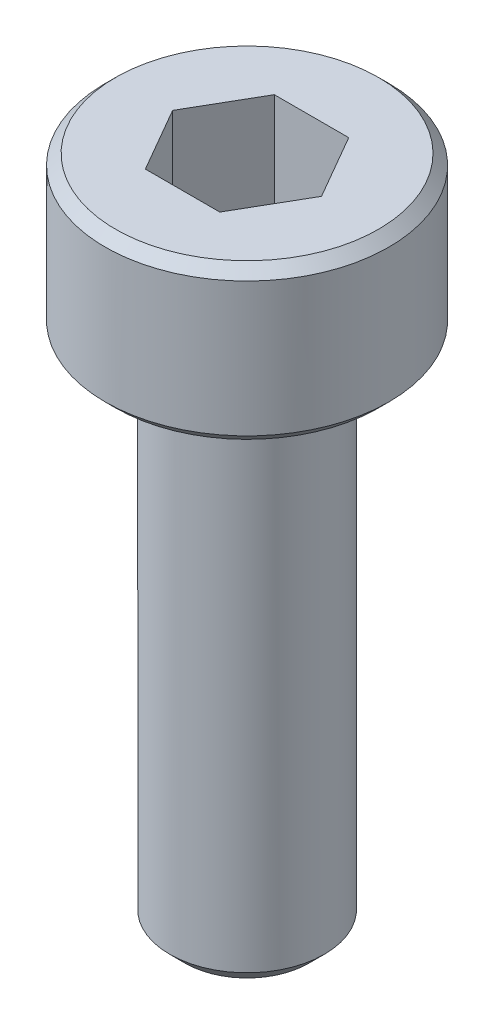
ISO-10303-21;
HEADER;
FILE_DESCRIPTION(('STEP AP214'),'2;1');
FILE_NAME('part.step','',(''),(''),'','','');
FILE_SCHEMA(('AUTOMOTIVE_DESIGN { 1 0 10303 214 1 1 1 1 }'));
ENDSEC;
DATA;
#1=APPLICATION_CONTEXT('core data for automotive mechanical design processes');
#2=APPLICATION_PROTOCOL_DEFINITION('international standard','automotive_design',2000,#1);
#3=PRODUCT_CONTEXT('',#1,'mechanical');
#4=PRODUCT('Part','Part','',(#3));
#5=PRODUCT_RELATED_PRODUCT_CATEGORY('part','',(#4));
#6=PRODUCT_DEFINITION_FORMATION('','',#4);
#7=PRODUCT_DEFINITION_CONTEXT('part definition',#1,'design');
#8=PRODUCT_DEFINITION('design','',#6,#7);
#9=PRODUCT_DEFINITION_SHAPE('','',#8);
#10=(LENGTH_UNIT() NAMED_UNIT(*) SI_UNIT(.MILLI.,.METRE.));
#11=(NAMED_UNIT(*) PLANE_ANGLE_UNIT() SI_UNIT($,.RADIAN.));
#12=(NAMED_UNIT(*) SI_UNIT($,.STERADIAN.) SOLID_ANGLE_UNIT());
#13=UNCERTAINTY_MEASURE_WITH_UNIT(LENGTH_MEASURE(1.E-05),#10,'distance_accuracy_value','');
#14=(GEOMETRIC_REPRESENTATION_CONTEXT(3) GLOBAL_UNCERTAINTY_ASSIGNED_CONTEXT((#13)) GLOBAL_UNIT_ASSIGNED_CONTEXT((#10,
#11,#12)) REPRESENTATION_CONTEXT('',''));
#15=CARTESIAN_POINT('',(0.,0.,0.));
#16=DIRECTION('',(0.,0.,1.));
#17=DIRECTION('',(1.,0.,0.));
#18=AXIS2_PLACEMENT_3D('',#15,#16,#17);
#19=CARTESIAN_POINT('',(0.721687836487033,11.,1.25));
#20=DIRECTION('',(0.866025403784439,0.,0.5));
#21=DIRECTION('',(0.5,0.,-0.866025403784439));
#22=AXIS2_PLACEMENT_3D('',#19,#20,#21);
#23=PLANE('',#22);
#24=DIRECTION('',(0.5,0.,-0.866025403784439));
#25=VECTOR('',#24,1.);
#26=CARTESIAN_POINT('',(0.721687836487033,11.,1.25));
#27=LINE('',#26,#25);
#28=CARTESIAN_POINT('',(0.721687836487033,11.,1.25));
#29=VERTEX_POINT('',#28);
#30=CARTESIAN_POINT('',(1.44337567297406,11.,0.));
#31=VERTEX_POINT('',#30);
#32=EDGE_CURVE('E66',#29,#31,#27,.T.);
#33=ORIENTED_EDGE('',*,*,#32,.F.);
#34=DIRECTION('',(0.,1.,0.));
#35=VECTOR('',#34,1.);
#36=CARTESIAN_POINT('',(0.721687836487033,11.,1.25));
#37=LINE('',#36,#35);
#38=CARTESIAN_POINT('',(0.721687836487033,13.,1.25));
#39=VERTEX_POINT('',#38);
#40=EDGE_CURVE('E85',#29,#39,#37,.T.);
#41=ORIENTED_EDGE('',*,*,#40,.T.);
#42=DIRECTION('',(0.5,0.,-0.866025403784439));
#43=VECTOR('',#42,1.);
#44=CARTESIAN_POINT('',(0.721687836487033,13.,1.25));
#45=LINE('',#44,#43);
#46=CARTESIAN_POINT('',(1.44337567297406,13.,0.));
#47=VERTEX_POINT('',#46);
#48=EDGE_CURVE('E73',#47,#39,#45,.F.);
#49=ORIENTED_EDGE('',*,*,#48,.F.);
#50=DIRECTION('',(0.,1.,0.));
#51=VECTOR('',#50,1.);
#52=CARTESIAN_POINT('',(1.44337567297406,11.,0.));
#53=LINE('',#52,#51);
#54=EDGE_CURVE('E80',#47,#31,#53,.F.);
#55=ORIENTED_EDGE('',*,*,#54,.T.);
#56=EDGE_LOOP('',(#33,#41,#49,#55));
#57=FACE_BOUND('',#56,.T.);
#58=ADVANCED_FACE('F17',(#57),#23,.F.);
#59=CARTESIAN_POINT('',(1.44337567297406,11.,0.));
#60=DIRECTION('',(0.866025403784438,0.,-0.5));
#61=DIRECTION('',(-0.5,0.,-0.866025403784438));
#62=AXIS2_PLACEMENT_3D('',#59,#60,#61);
#63=PLANE('',#62);
#64=DIRECTION('',(-0.5,0.,-0.866025403784438));
#65=VECTOR('',#64,1.);
#66=CARTESIAN_POINT('',(1.44337567297406,11.,0.));
#67=LINE('',#66,#65);
#68=CARTESIAN_POINT('',(0.721687836487031,11.,-1.25));
#69=VERTEX_POINT('',#68);
#70=EDGE_CURVE('E89',#31,#69,#67,.T.);
#71=ORIENTED_EDGE('',*,*,#70,.F.);
#72=ORIENTED_EDGE('',*,*,#54,.F.);
#73=DIRECTION('',(-0.5,0.,-0.866025403784438));
#74=VECTOR('',#73,1.);
#75=CARTESIAN_POINT('',(1.44337567297406,13.,0.));
#76=LINE('',#75,#74);
#77=CARTESIAN_POINT('',(0.721687836487032,13.,-1.25));
#78=VERTEX_POINT('',#77);
#79=EDGE_CURVE('E70',#78,#47,#76,.F.);
#80=ORIENTED_EDGE('',*,*,#79,.F.);
#81=DIRECTION('',(0.,1.,0.));
#82=VECTOR('',#81,1.);
#83=CARTESIAN_POINT('',(0.721687836487031,11.,-1.25));
#84=LINE('',#83,#82);
#85=EDGE_CURVE('E133',#78,#69,#84,.F.);
#86=ORIENTED_EDGE('',*,*,#85,.T.);
#87=EDGE_LOOP('',(#71,#72,#80,#86));
#88=FACE_BOUND('',#87,.T.);
#89=ADVANCED_FACE('F88',(#88),#63,.F.);
#90=CARTESIAN_POINT('',(-0.721687836487032,11.,1.25));
#91=DIRECTION('',(0.,0.,1.));
#92=DIRECTION('',(1.,0.,0.));
#93=AXIS2_PLACEMENT_3D('',#90,#91,#92);
#94=PLANE('',#93);
#95=DIRECTION('',(1.,0.,0.));
#96=VECTOR('',#95,1.);
#97=CARTESIAN_POINT('',(1.44337567297406,11.,1.25));
#98=LINE('',#97,#96);
#99=CARTESIAN_POINT('',(-0.721687836487032,11.,1.25));
#100=VERTEX_POINT('',#99);
#101=EDGE_CURVE('E131',#100,#29,#98,.T.);
#102=ORIENTED_EDGE('',*,*,#101,.F.);
#103=DIRECTION('',(0.,1.,0.));
#104=VECTOR('',#103,1.);
#105=CARTESIAN_POINT('',(-0.721687836487032,11.,1.25));
#106=LINE('',#105,#104);
#107=CARTESIAN_POINT('',(-0.721687836487032,13.,1.25));
#108=VERTEX_POINT('',#107);
#109=EDGE_CURVE('E121',#100,#108,#106,.T.);
#110=ORIENTED_EDGE('',*,*,#109,.T.);
#111=DIRECTION('',(1.,0.,0.));
#112=VECTOR('',#111,1.);
#113=CARTESIAN_POINT('',(-0.721687836487032,13.,1.25));
#114=LINE('',#113,#112);
#115=EDGE_CURVE('E91',#39,#108,#114,.F.);
#116=ORIENTED_EDGE('',*,*,#115,.F.);
#117=ORIENTED_EDGE('',*,*,#40,.F.);
#118=EDGE_LOOP('',(#102,#110,#116,#117));
#119=FACE_BOUND('',#118,.T.);
#120=ADVANCED_FACE('F138',(#119),#94,.F.);
#121=CARTESIAN_POINT('',(0.721687836487031,11.,-1.25));
#122=DIRECTION('',(0.,0.,-1.));
#123=DIRECTION('',(-1.,0.,0.));
#124=AXIS2_PLACEMENT_3D('',#121,#122,#123);
#125=PLANE('',#124);
#126=DIRECTION('',(1.,0.,0.));
#127=VECTOR('',#126,1.);
#128=CARTESIAN_POINT('',(1.44337567297406,11.,-1.25));
#129=LINE('',#128,#127);
#130=CARTESIAN_POINT('',(-0.721687836487032,11.,-1.25));
#131=VERTEX_POINT('',#130);
#132=EDGE_CURVE('E128',#69,#131,#129,.F.);
#133=ORIENTED_EDGE('',*,*,#132,.F.);
#134=ORIENTED_EDGE('',*,*,#85,.F.);
#135=DIRECTION('',(-1.,0.,0.));
#136=VECTOR('',#135,1.);
#137=CARTESIAN_POINT('',(0.721687836487031,13.,-1.25));
#138=LINE('',#137,#136);
#139=CARTESIAN_POINT('',(-0.721687836487032,13.,-1.25));
#140=VERTEX_POINT('',#139);
#141=EDGE_CURVE('E75',#140,#78,#138,.F.);
#142=ORIENTED_EDGE('',*,*,#141,.F.);
#143=DIRECTION('',(0.,1.,0.));
#144=VECTOR('',#143,1.);
#145=CARTESIAN_POINT('',(-0.721687836487032,11.,-1.25));
#146=LINE('',#145,#144);
#147=EDGE_CURVE('E119',#140,#131,#146,.F.);
#148=ORIENTED_EDGE('',*,*,#147,.T.);
#149=EDGE_LOOP('',(#133,#134,#142,#148));
#150=FACE_BOUND('',#149,.T.);
#151=ADVANCED_FACE('F150',(#150),#125,.F.);
#152=CARTESIAN_POINT('',(1.44337567297406,11.,0.));
#153=DIRECTION('',(0.,1.,0.));
#154=DIRECTION('',(0.,0.,1.));
#155=AXIS2_PLACEMENT_3D('',#152,#153,#154);
#156=PLANE('',#155);
#157=ORIENTED_EDGE('',*,*,#132,.T.);
#158=DIRECTION('',(-0.5,0.,0.866025403784439));
#159=VECTOR('',#158,1.);
#160=CARTESIAN_POINT('',(-0.721687836487032,11.,-1.25));
#161=LINE('',#160,#159);
#162=CARTESIAN_POINT('',(-1.44337567297406,11.,0.));
#163=VERTEX_POINT('',#162);
#164=EDGE_CURVE('E117',#131,#163,#161,.T.);
#165=ORIENTED_EDGE('',*,*,#164,.T.);
#166=DIRECTION('',(0.5,0.,0.866025403784438));
#167=VECTOR('',#166,1.);
#168=CARTESIAN_POINT('',(-1.44337567297406,11.,0.));
#169=LINE('',#168,#167);
#170=EDGE_CURVE('E124',#163,#100,#169,.T.);
#171=ORIENTED_EDGE('',*,*,#170,.T.);
#172=ORIENTED_EDGE('',*,*,#101,.T.);
#173=ORIENTED_EDGE('',*,*,#32,.T.);
#174=ORIENTED_EDGE('',*,*,#70,.T.);
#175=EDGE_LOOP('',(#157,#165,#171,#172,#173,#174));
#176=FACE_BOUND('',#175,.T.);
#177=ADVANCED_FACE('F151',(#176),#156,.T.);
#178=CARTESIAN_POINT('',(-1.44337567297406,11.,0.));
#179=DIRECTION('',(-0.866025403784438,0.,0.5));
#180=DIRECTION('',(0.5,0.,0.866025403784438));
#181=AXIS2_PLACEMENT_3D('',#178,#179,#180);
#182=PLANE('',#181);
#183=ORIENTED_EDGE('',*,*,#170,.F.);
#184=DIRECTION('',(0.,1.,0.));
#185=VECTOR('',#184,1.);
#186=CARTESIAN_POINT('',(-1.44337567297407,11.,0.));
#187=LINE('',#186,#185);
#188=CARTESIAN_POINT('',(-1.44337567297406,13.,0.));
#189=VERTEX_POINT('',#188);
#190=EDGE_CURVE('E115',#163,#189,#187,.T.);
#191=ORIENTED_EDGE('',*,*,#190,.T.);
#192=DIRECTION('',(0.5,0.,0.866025403784438));
#193=VECTOR('',#192,1.);
#194=CARTESIAN_POINT('',(-1.44337567297406,13.,0.));
#195=LINE('',#194,#193);
#196=EDGE_CURVE('E35',#108,#189,#195,.F.);
#197=ORIENTED_EDGE('',*,*,#196,.F.);
#198=ORIENTED_EDGE('',*,*,#109,.F.);
#199=EDGE_LOOP('',(#183,#191,#197,#198));
#200=FACE_BOUND('',#199,.T.);
#201=ADVANCED_FACE('F141',(#200),#182,.F.);
#202=CARTESIAN_POINT('',(-0.721687836487032,11.,-1.25));
#203=DIRECTION('',(-0.866025403784439,0.,-0.5));
#204=DIRECTION('',(-0.5,0.,0.866025403784439));
#205=AXIS2_PLACEMENT_3D('',#202,#203,#204);
#206=PLANE('',#205);
#207=ORIENTED_EDGE('',*,*,#164,.F.);
#208=ORIENTED_EDGE('',*,*,#147,.F.);
#209=DIRECTION('',(0.5,0.,-0.866025403784438));
#210=VECTOR('',#209,1.);
#211=CARTESIAN_POINT('',(-1.44337567297406,13.,0.));
#212=LINE('',#211,#210);
#213=EDGE_CURVE('E113',#189,#140,#212,.T.);
#214=ORIENTED_EDGE('',*,*,#213,.F.);
#215=ORIENTED_EDGE('',*,*,#190,.F.);
#216=EDGE_LOOP('',(#207,#208,#214,#215));
#217=FACE_BOUND('',#216,.T.);
#218=ADVANCED_FACE('F147',(#217),#206,.F.);
#219=CARTESIAN_POINT('',(0.,13.,-2.75));
#220=DIRECTION('',(0.,1.,0.));
#221=DIRECTION('',(0.,0.,1.));
#222=AXIS2_PLACEMENT_3D('',#219,#220,#221);
#223=PLANE('',#222);
#224=CARTESIAN_POINT('',(0.,13.0000000000337,0.));
#225=DIRECTION('',(0.,-1.,0.));
#226=DIRECTION('',(0.,0.,-1.));
#227=AXIS2_PLACEMENT_3D('',#224,#225,#226);
#228=CIRCLE('',#227,2.54999999992833);
#229=CARTESIAN_POINT('',(0.,13.0000000000337,-2.54999999992833));
#230=VERTEX_POINT('',#229);
#231=EDGE_CURVE('E20',#230,#230,#228,.T.);
#232=ORIENTED_EDGE('',*,*,#231,.F.);
#233=EDGE_LOOP('',(#232));
#234=FACE_BOUND('',#233,.T.);
#235=ORIENTED_EDGE('',*,*,#196,.T.);
#236=ORIENTED_EDGE('',*,*,#213,.T.);
#237=ORIENTED_EDGE('',*,*,#141,.T.);
#238=ORIENTED_EDGE('',*,*,#79,.T.);
#239=ORIENTED_EDGE('',*,*,#48,.T.);
#240=ORIENTED_EDGE('',*,*,#115,.T.);
#241=EDGE_LOOP('',(#235,#236,#237,#238,#239,#240));
#242=FACE_BOUND('',#241,.T.);
#243=ADVANCED_FACE('F72',(#234,#242),#223,.T.);
#244=CARTESIAN_POINT('',(0.,12.8000000000839,0.));
#245=DIRECTION('',(0.,-1.,0.));
#246=DIRECTION('',(0.,0.,-1.));
#247=AXIS2_PLACEMENT_3D('',#244,#245,#246);
#248=CONICAL_SURFACE('',#247,2.74999999987813,0.785398163397448);
#249=CARTESIAN_POINT('',(0.,12.8,0.));
#250=DIRECTION('',(0.,-1.,0.));
#251=DIRECTION('',(0.,0.,-1.));
#252=AXIS2_PLACEMENT_3D('',#249,#250,#251);
#253=CIRCLE('',#252,2.75);
#254=CARTESIAN_POINT('',(0.,12.8,-2.75));
#255=VERTEX_POINT('',#254);
#256=EDGE_CURVE('E106',#255,#255,#253,.T.);
#257=ORIENTED_EDGE('',*,*,#256,.F.);
#258=EDGE_LOOP('',(#257));
#259=FACE_BOUND('',#258,.T.);
#260=ORIENTED_EDGE('',*,*,#231,.T.);
#261=EDGE_LOOP('',(#260));
#262=FACE_BOUND('',#261,.T.);
#263=ADVANCED_FACE('F186',(#259,#262),#248,.T.);
#264=CARTESIAN_POINT('',(0.,0.,0.));
#265=DIRECTION('',(0.,-1.,0.));
#266=DIRECTION('',(0.,0.,-1.));
#267=AXIS2_PLACEMENT_3D('',#264,#265,#266);
#268=CYLINDRICAL_SURFACE('',#267,2.75);
#269=CARTESIAN_POINT('',(0.,10.1999999999407,0.));
#270=DIRECTION('',(0.,1.,0.));
#271=DIRECTION('',(0.,0.,1.));
#272=AXIS2_PLACEMENT_3D('',#269,#270,#271);
#273=CIRCLE('',#272,2.74999999993497);
#274=CARTESIAN_POINT('',(0.,10.1999999999407,2.74999999993497));
#275=VERTEX_POINT('',#274);
#276=EDGE_CURVE('E102',#275,#275,#273,.F.);
#277=ORIENTED_EDGE('',*,*,#276,.F.);
#278=EDGE_LOOP('',(#277));
#279=FACE_BOUND('',#278,.T.);
#280=ORIENTED_EDGE('',*,*,#256,.T.);
#281=EDGE_LOOP('',(#280));
#282=FACE_BOUND('',#281,.T.);
#283=ADVANCED_FACE('F183',(#279,#282),#268,.T.);
#284=CARTESIAN_POINT('',(0.,10.199999999827,0.));
#285=DIRECTION('',(0.,1.,0.));
#286=DIRECTION('',(0.,0.,1.));
#287=AXIS2_PLACEMENT_3D('',#284,#285,#286);
#288=CONICAL_SURFACE('',#287,2.74999999982128,0.785398163397448);
#289=ORIENTED_EDGE('',*,*,#276,.T.);
#290=EDGE_LOOP('',(#289));
#291=FACE_BOUND('',#290,.T.);
#292=CARTESIAN_POINT('',(0.,9.99999999993406,0.));
#293=DIRECTION('',(0.,1.,0.));
#294=DIRECTION('',(0.,0.,1.));
#295=AXIS2_PLACEMENT_3D('',#292,#293,#294);
#296=CIRCLE('',#295,2.54999999992833);
#297=CARTESIAN_POINT('',(0.,9.99999999993406,2.54999999992833));
#298=VERTEX_POINT('',#297);
#299=EDGE_CURVE('E100',#298,#298,#296,.F.);
#300=ORIENTED_EDGE('',*,*,#299,.F.);
#301=EDGE_LOOP('',(#300));
#302=FACE_BOUND('',#301,.T.);
#303=ADVANCED_FACE('F179',(#291,#302),#288,.T.);
#304=CARTESIAN_POINT('',(0.,0.,0.));
#305=DIRECTION('',(0.,-1.,0.));
#306=DIRECTION('',(0.,0.,-1.));
#307=AXIS2_PLACEMENT_3D('',#304,#305,#306);
#308=PLANE('',#307);
#309=CARTESIAN_POINT('',(0.,5.6843418860808E-11,0.));
#310=DIRECTION('',(0.,1.,0.));
#311=DIRECTION('',(0.,0.,1.));
#312=AXIS2_PLACEMENT_3D('',#309,#310,#311);
#313=CIRCLE('',#312,1.20000000003984);
#314=CARTESIAN_POINT('',(0.,5.6843418860808E-11,1.20000000003984));
#315=VERTEX_POINT('',#314);
#316=EDGE_CURVE('E98',#315,#315,#313,.T.);
#317=ORIENTED_EDGE('',*,*,#316,.F.);
#318=EDGE_LOOP('',(#317));
#319=FACE_BOUND('',#318,.T.);
#320=ADVANCED_FACE('F176',(#319),#308,.T.);
#321=CARTESIAN_POINT('',(0.,10.,-1.5));
#322=DIRECTION('',(0.,-1.,0.));
#323=DIRECTION('',(0.,0.,-1.));
#324=AXIS2_PLACEMENT_3D('',#321,#322,#323);
#325=PLANE('',#324);
#326=ORIENTED_EDGE('',*,*,#299,.T.);
#327=EDGE_LOOP('',(#326));
#328=FACE_BOUND('',#327,.T.);
#329=CARTESIAN_POINT('',(0.,10.,0.));
#330=DIRECTION('',(0.,-1.,0.));
#331=DIRECTION('',(0.,0.,-1.));
#332=AXIS2_PLACEMENT_3D('',#329,#330,#331);
#333=CIRCLE('',#332,1.5);
#334=CARTESIAN_POINT('',(0.,10.,-1.5));
#335=VERTEX_POINT('',#334);
#336=EDGE_CURVE('E26',#335,#335,#333,.T.);
#337=ORIENTED_EDGE('',*,*,#336,.F.);
#338=EDGE_LOOP('',(#337));
#339=FACE_BOUND('',#338,.T.);
#340=ADVANCED_FACE('F169',(#328,#339),#325,.T.);
#341=CARTESIAN_POINT('',(0.,0.300000000038381,0.));
#342=DIRECTION('',(0.,1.,0.));
#343=DIRECTION('',(0.,0.,1.));
#344=AXIS2_PLACEMENT_3D('',#341,#342,#343);
#345=CONICAL_SURFACE('',#344,1.50000000002137,0.785398163397448);
#346=CARTESIAN_POINT('',(0.,0.300000000000003,0.));
#347=DIRECTION('',(0.,-1.,0.));
#348=DIRECTION('',(0.,0.,-1.));
#349=AXIS2_PLACEMENT_3D('',#346,#347,#348);
#350=CIRCLE('',#349,1.5);
#351=CARTESIAN_POINT('',(0.,0.300000000000003,-1.5));
#352=VERTEX_POINT('',#351);
#353=EDGE_CURVE('E11',#352,#352,#350,.F.);
#354=ORIENTED_EDGE('',*,*,#353,.F.);
#355=EDGE_LOOP('',(#354));
#356=FACE_BOUND('',#355,.T.);
#357=ORIENTED_EDGE('',*,*,#316,.T.);
#358=EDGE_LOOP('',(#357));
#359=FACE_BOUND('',#358,.T.);
#360=ADVANCED_FACE('F163',(#356,#359),#345,.T.);
#361=CARTESIAN_POINT('',(0.,0.,0.));
#362=DIRECTION('',(0.,-1.,0.));
#363=DIRECTION('',(0.,0.,-1.));
#364=AXIS2_PLACEMENT_3D('',#361,#362,#363);
#365=CYLINDRICAL_SURFACE('',#364,1.5);
#366=ORIENTED_EDGE('',*,*,#353,.T.);
#367=EDGE_LOOP('',(#366));
#368=FACE_BOUND('',#367,.T.);
#369=ORIENTED_EDGE('',*,*,#336,.T.);
#370=EDGE_LOOP('',(#369));
#371=FACE_BOUND('',#370,.T.);
#372=ADVANCED_FACE('F161',(#368,#371),#365,.T.);
#373=CLOSED_SHELL('',(#58,#89,#120,#151,#177,#201,#218,#243,#263,#283,#303,#320,#340,#360,#372));
#374=MANIFOLD_SOLID_BREP('B1',#373);
#375=ADVANCED_BREP_SHAPE_REPRESENTATION('',(#18,#374),#14);
#376=SHAPE_DEFINITION_REPRESENTATION(#9,#375);
ENDSEC;
END-ISO-10303-21;
